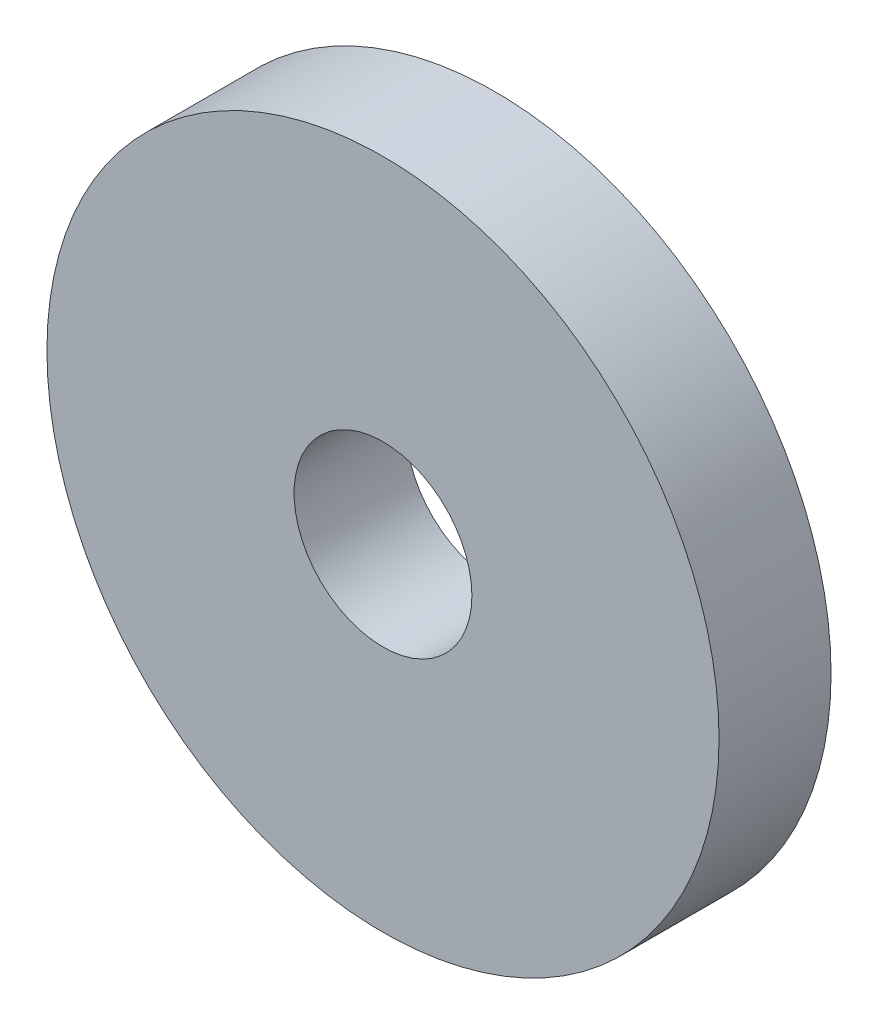
ISO-10303-21;
HEADER;
FILE_DESCRIPTION(('STEP AP214'),'2;1');
FILE_NAME('part.step','',(''),(''),'','','');
FILE_SCHEMA(('AUTOMOTIVE_DESIGN { 1 0 10303 214 1 1 1 1 }'));
ENDSEC;
DATA;
#1=APPLICATION_CONTEXT('core data for automotive mechanical design processes');
#2=APPLICATION_PROTOCOL_DEFINITION('international standard','automotive_design',2000,#1);
#3=PRODUCT_CONTEXT('',#1,'mechanical');
#4=PRODUCT('Part','Part','',(#3));
#5=PRODUCT_RELATED_PRODUCT_CATEGORY('part','',(#4));
#6=PRODUCT_DEFINITION_FORMATION('','',#4);
#7=PRODUCT_DEFINITION_CONTEXT('part definition',#1,'design');
#8=PRODUCT_DEFINITION('design','',#6,#7);
#9=PRODUCT_DEFINITION_SHAPE('','',#8);
#10=(LENGTH_UNIT() NAMED_UNIT(*) SI_UNIT(.MILLI.,.METRE.));
#11=(NAMED_UNIT(*) PLANE_ANGLE_UNIT() SI_UNIT($,.RADIAN.));
#12=(NAMED_UNIT(*) SI_UNIT($,.STERADIAN.) SOLID_ANGLE_UNIT());
#13=UNCERTAINTY_MEASURE_WITH_UNIT(LENGTH_MEASURE(1.E-05),#10,'distance_accuracy_value','');
#14=(GEOMETRIC_REPRESENTATION_CONTEXT(3) GLOBAL_UNCERTAINTY_ASSIGNED_CONTEXT((#13)) GLOBAL_UNIT_ASSIGNED_CONTEXT((#10,
#11,#12)) REPRESENTATION_CONTEXT('',''));
#15=CARTESIAN_POINT('',(0.,0.,0.));
#16=DIRECTION('',(0.,0.,1.));
#17=DIRECTION('',(1.,0.,0.));
#18=AXIS2_PLACEMENT_3D('',#15,#16,#17);
#19=CARTESIAN_POINT('',(0.,0.,4.));
#20=DIRECTION('',(0.,0.,1.));
#21=DIRECTION('',(1.,0.,0.));
#22=AXIS2_PLACEMENT_3D('',#19,#20,#21);
#23=PLANE('',#22);
#24=CARTESIAN_POINT('',(0.,0.,4.));
#25=DIRECTION('',(0.,0.,1.));
#26=DIRECTION('',(1.,0.,0.));
#27=AXIS2_PLACEMENT_3D('',#24,#25,#26);
#28=CIRCLE('',#27,12.);
#29=CARTESIAN_POINT('',(12.,0.,4.));
#30=VERTEX_POINT('',#29);
#31=EDGE_CURVE('E10',#30,#30,#28,.T.);
#32=ORIENTED_EDGE('',*,*,#31,.T.);
#33=EDGE_LOOP('',(#32));
#34=FACE_BOUND('',#33,.T.);
#35=CARTESIAN_POINT('',(0.,0.,4.));
#36=DIRECTION('',(0.,0.,1.));
#37=DIRECTION('',(1.,0.,0.));
#38=AXIS2_PLACEMENT_3D('',#35,#36,#37);
#39=CIRCLE('',#38,3.175);
#40=CARTESIAN_POINT('',(3.175,0.,4.));
#41=VERTEX_POINT('',#40);
#42=EDGE_CURVE('E42',#41,#41,#39,.T.);
#43=ORIENTED_EDGE('',*,*,#42,.F.);
#44=EDGE_LOOP('',(#43));
#45=FACE_BOUND('',#44,.T.);
#46=ADVANCED_FACE('F31',(#34,#45),#23,.T.);
#47=CARTESIAN_POINT('',(0.,0.,0.));
#48=DIRECTION('',(0.,0.,1.));
#49=DIRECTION('',(1.,0.,0.));
#50=AXIS2_PLACEMENT_3D('',#47,#48,#49);
#51=PLANE('',#50);
#52=CARTESIAN_POINT('',(0.,0.,0.));
#53=DIRECTION('',(0.,0.,1.));
#54=DIRECTION('',(1.,0.,0.));
#55=AXIS2_PLACEMENT_3D('',#52,#53,#54);
#56=CIRCLE('',#55,12.);
#57=CARTESIAN_POINT('',(12.,0.,0.));
#58=VERTEX_POINT('',#57);
#59=EDGE_CURVE('E35',#58,#58,#56,.T.);
#60=ORIENTED_EDGE('',*,*,#59,.F.);
#61=EDGE_LOOP('',(#60));
#62=FACE_BOUND('',#61,.T.);
#63=CARTESIAN_POINT('',(0.,0.,0.));
#64=DIRECTION('',(0.,0.,1.));
#65=DIRECTION('',(1.,0.,0.));
#66=AXIS2_PLACEMENT_3D('',#63,#64,#65);
#67=CIRCLE('',#66,3.175);
#68=CARTESIAN_POINT('',(3.175,0.,0.));
#69=VERTEX_POINT('',#68);
#70=EDGE_CURVE('E44',#69,#69,#67,.T.);
#71=ORIENTED_EDGE('',*,*,#70,.T.);
#72=EDGE_LOOP('',(#71));
#73=FACE_BOUND('',#72,.T.);
#74=ADVANCED_FACE('F54',(#62,#73),#51,.F.);
#75=CARTESIAN_POINT('',(0.,0.,4.));
#76=DIRECTION('',(0.,0.,-1.));
#77=DIRECTION('',(-1.,0.,0.));
#78=AXIS2_PLACEMENT_3D('',#75,#76,#77);
#79=CYLINDRICAL_SURFACE('',#78,12.);
#80=ORIENTED_EDGE('',*,*,#31,.F.);
#81=EDGE_LOOP('',(#80));
#82=FACE_BOUND('',#81,.T.);
#83=ORIENTED_EDGE('',*,*,#59,.T.);
#84=EDGE_LOOP('',(#83));
#85=FACE_BOUND('',#84,.T.);
#86=ADVANCED_FACE('F33',(#82,#85),#79,.T.);
#87=CARTESIAN_POINT('',(0.,0.,4.));
#88=DIRECTION('',(0.,0.,-1.));
#89=DIRECTION('',(-1.,0.,0.));
#90=AXIS2_PLACEMENT_3D('',#87,#88,#89);
#91=CYLINDRICAL_SURFACE('',#90,3.175);
#92=ORIENTED_EDGE('',*,*,#42,.T.);
#93=EDGE_LOOP('',(#92));
#94=FACE_BOUND('',#93,.T.);
#95=ORIENTED_EDGE('',*,*,#70,.F.);
#96=EDGE_LOOP('',(#95));
#97=FACE_BOUND('',#96,.T.);
#98=ADVANCED_FACE('F50',(#94,#97),#91,.F.);
#99=CLOSED_SHELL('',(#46,#74,#86,#98));
#100=MANIFOLD_SOLID_BREP('B2',#99);
#101=ADVANCED_BREP_SHAPE_REPRESENTATION('',(#18,#100),#14);
#102=SHAPE_DEFINITION_REPRESENTATION(#9,#101);
ENDSEC;
END-ISO-10303-21;
